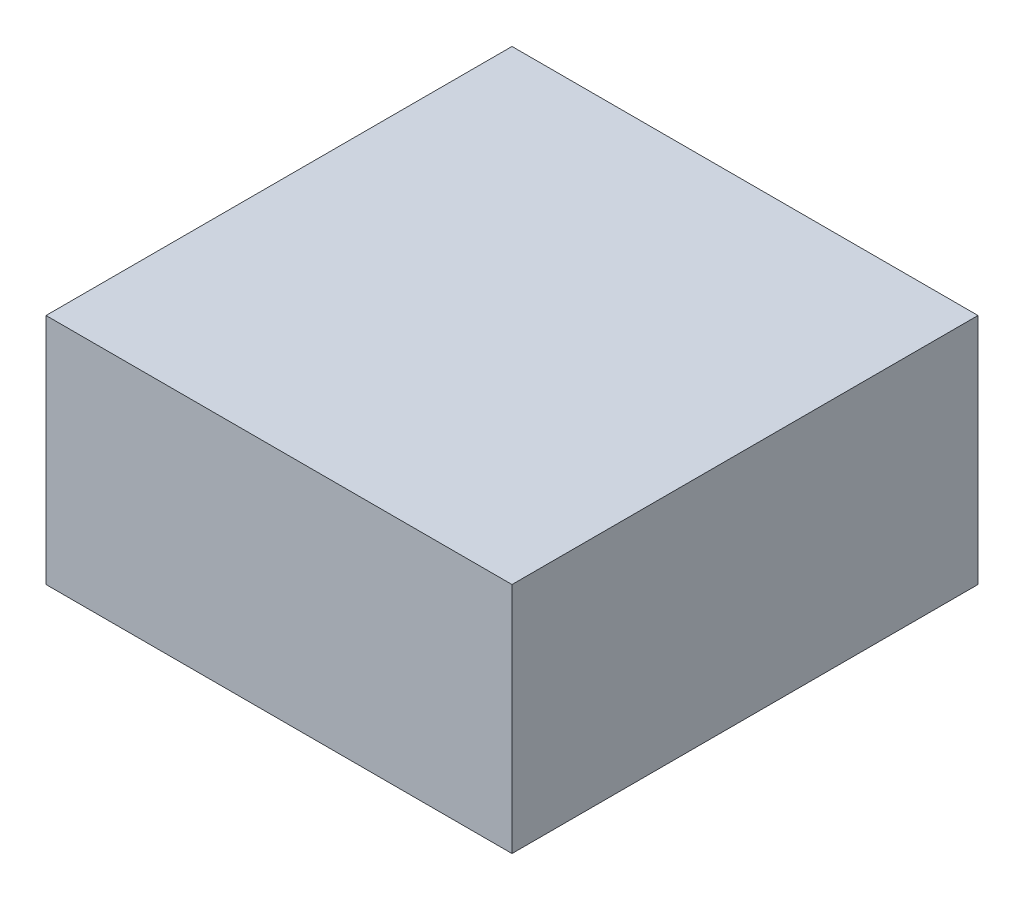
ISO-10303-21;
HEADER;
FILE_DESCRIPTION(('STEP AP214'),'2;1');
FILE_NAME('part.step','',(''),(''),'','','');
FILE_SCHEMA(('AUTOMOTIVE_DESIGN { 1 0 10303 214 1 1 1 1 }'));
ENDSEC;
DATA;
#1=APPLICATION_CONTEXT('core data for automotive mechanical design processes');
#2=APPLICATION_PROTOCOL_DEFINITION('international standard','automotive_design',2000,#1);
#3=PRODUCT_CONTEXT('',#1,'mechanical');
#4=PRODUCT('Part','Part','',(#3));
#5=PRODUCT_RELATED_PRODUCT_CATEGORY('part','',(#4));
#6=PRODUCT_DEFINITION_FORMATION('','',#4);
#7=PRODUCT_DEFINITION_CONTEXT('part definition',#1,'design');
#8=PRODUCT_DEFINITION('design','',#6,#7);
#9=PRODUCT_DEFINITION_SHAPE('','',#8);
#10=(LENGTH_UNIT() NAMED_UNIT(*) SI_UNIT(.MILLI.,.METRE.));
#11=(NAMED_UNIT(*) PLANE_ANGLE_UNIT() SI_UNIT($,.RADIAN.));
#12=(NAMED_UNIT(*) SI_UNIT($,.STERADIAN.) SOLID_ANGLE_UNIT());
#13=UNCERTAINTY_MEASURE_WITH_UNIT(LENGTH_MEASURE(1.E-05),#10,'distance_accuracy_value','');
#14=(GEOMETRIC_REPRESENTATION_CONTEXT(3) GLOBAL_UNCERTAINTY_ASSIGNED_CONTEXT((#13)) GLOBAL_UNIT_ASSIGNED_CONTEXT((#10,
#11,#12)) REPRESENTATION_CONTEXT('',''));
#15=CARTESIAN_POINT('',(0.,0.,0.));
#16=DIRECTION('',(0.,0.,1.));
#17=DIRECTION('',(1.,0.,0.));
#18=AXIS2_PLACEMENT_3D('',#15,#16,#17);
#19=CARTESIAN_POINT('',(0.,200.,0.));
#20=DIRECTION('',(1.,0.,0.));
#21=DIRECTION('',(0.,0.,-1.));
#22=AXIS2_PLACEMENT_3D('',#19,#20,#21);
#23=PLANE('',#22);
#24=DIRECTION('',(0.,0.,1.));
#25=VECTOR('',#24,1.);
#26=CARTESIAN_POINT('',(0.,0.,0.));
#27=LINE('',#26,#25);
#28=CARTESIAN_POINT('',(0.,0.,-400.));
#29=VERTEX_POINT('',#28);
#30=CARTESIAN_POINT('',(0.,0.,0.));
#31=VERTEX_POINT('',#30);
#32=EDGE_CURVE('E107',#29,#31,#27,.T.);
#33=ORIENTED_EDGE('',*,*,#32,.T.);
#34=DIRECTION('',(0.,-1.,0.));
#35=VECTOR('',#34,1.);
#36=CARTESIAN_POINT('',(0.,200.,0.));
#37=LINE('',#36,#35);
#38=CARTESIAN_POINT('',(0.,200.,0.));
#39=VERTEX_POINT('',#38);
#40=EDGE_CURVE('E11',#39,#31,#37,.T.);
#41=ORIENTED_EDGE('',*,*,#40,.F.);
#42=DIRECTION('',(0.,0.,1.));
#43=VECTOR('',#42,1.);
#44=CARTESIAN_POINT('',(0.,200.,0.));
#45=LINE('',#44,#43);
#46=CARTESIAN_POINT('',(0.,200.,-400.));
#47=VERTEX_POINT('',#46);
#48=EDGE_CURVE('E91',#47,#39,#45,.T.);
#49=ORIENTED_EDGE('',*,*,#48,.F.);
#50=DIRECTION('',(0.,-1.,0.));
#51=VECTOR('',#50,1.);
#52=CARTESIAN_POINT('',(0.,200.,-400.));
#53=LINE('',#52,#51);
#54=EDGE_CURVE('E103',#47,#29,#53,.T.);
#55=ORIENTED_EDGE('',*,*,#54,.T.);
#56=EDGE_LOOP('',(#33,#41,#49,#55));
#57=FACE_BOUND('',#56,.T.);
#58=ADVANCED_FACE('F39',(#57),#23,.F.);
#59=CARTESIAN_POINT('',(0.,200.,0.));
#60=DIRECTION('',(0.,0.,-1.));
#61=DIRECTION('',(-1.,0.,0.));
#62=AXIS2_PLACEMENT_3D('',#59,#60,#61);
#63=PLANE('',#62);
#64=DIRECTION('',(1.,0.,0.));
#65=VECTOR('',#64,1.);
#66=CARTESIAN_POINT('',(0.,0.,0.));
#67=LINE('',#66,#65);
#68=CARTESIAN_POINT('',(400.,0.,0.));
#69=VERTEX_POINT('',#68);
#70=EDGE_CURVE('E96',#31,#69,#67,.T.);
#71=ORIENTED_EDGE('',*,*,#70,.T.);
#72=DIRECTION('',(0.,-1.,0.));
#73=VECTOR('',#72,1.);
#74=CARTESIAN_POINT('',(400.,200.,0.));
#75=LINE('',#74,#73);
#76=CARTESIAN_POINT('',(400.,200.,0.));
#77=VERTEX_POINT('',#76);
#78=EDGE_CURVE('E48',#77,#69,#75,.T.);
#79=ORIENTED_EDGE('',*,*,#78,.F.);
#80=DIRECTION('',(1.,0.,0.));
#81=VECTOR('',#80,1.);
#82=CARTESIAN_POINT('',(0.,200.,0.));
#83=LINE('',#82,#81);
#84=EDGE_CURVE('E86',#39,#77,#83,.T.);
#85=ORIENTED_EDGE('',*,*,#84,.F.);
#86=ORIENTED_EDGE('',*,*,#40,.T.);
#87=EDGE_LOOP('',(#71,#79,#85,#86));
#88=FACE_BOUND('',#87,.T.);
#89=ADVANCED_FACE('F95',(#88),#63,.F.);
#90=CARTESIAN_POINT('',(400.,200.,0.));
#91=DIRECTION('',(-1.,0.,0.));
#92=DIRECTION('',(0.,0.,1.));
#93=AXIS2_PLACEMENT_3D('',#90,#91,#92);
#94=PLANE('',#93);
#95=DIRECTION('',(0.,0.,-1.));
#96=VECTOR('',#95,1.);
#97=CARTESIAN_POINT('',(400.,0.,0.));
#98=LINE('',#97,#96);
#99=CARTESIAN_POINT('',(400.,0.,-400.));
#100=VERTEX_POINT('',#99);
#101=EDGE_CURVE('E73',#69,#100,#98,.T.);
#102=ORIENTED_EDGE('',*,*,#101,.T.);
#103=DIRECTION('',(0.,-1.,0.));
#104=VECTOR('',#103,1.);
#105=CARTESIAN_POINT('',(400.,200.,-400.));
#106=LINE('',#105,#104);
#107=CARTESIAN_POINT('',(400.,200.,-400.));
#108=VERTEX_POINT('',#107);
#109=EDGE_CURVE('E98',#108,#100,#106,.T.);
#110=ORIENTED_EDGE('',*,*,#109,.F.);
#111=DIRECTION('',(0.,0.,-1.));
#112=VECTOR('',#111,1.);
#113=CARTESIAN_POINT('',(400.,200.,0.));
#114=LINE('',#113,#112);
#115=EDGE_CURVE('E89',#77,#108,#114,.T.);
#116=ORIENTED_EDGE('',*,*,#115,.F.);
#117=ORIENTED_EDGE('',*,*,#78,.T.);
#118=EDGE_LOOP('',(#102,#110,#116,#117));
#119=FACE_BOUND('',#118,.T.);
#120=ADVANCED_FACE('F99',(#119),#94,.F.);
#121=CARTESIAN_POINT('',(0.,200.,-400.));
#122=DIRECTION('',(0.,0.,1.));
#123=DIRECTION('',(1.,0.,0.));
#124=AXIS2_PLACEMENT_3D('',#121,#122,#123);
#125=PLANE('',#124);
#126=DIRECTION('',(-1.,0.,0.));
#127=VECTOR('',#126,1.);
#128=CARTESIAN_POINT('',(0.,0.,-400.));
#129=LINE('',#128,#127);
#130=EDGE_CURVE('E79',#100,#29,#129,.T.);
#131=ORIENTED_EDGE('',*,*,#130,.T.);
#132=ORIENTED_EDGE('',*,*,#54,.F.);
#133=DIRECTION('',(-1.,0.,0.));
#134=VECTOR('',#133,1.);
#135=CARTESIAN_POINT('',(0.,200.,-400.));
#136=LINE('',#135,#134);
#137=EDGE_CURVE('E56',#108,#47,#136,.T.);
#138=ORIENTED_EDGE('',*,*,#137,.F.);
#139=ORIENTED_EDGE('',*,*,#109,.T.);
#140=EDGE_LOOP('',(#131,#132,#138,#139));
#141=FACE_BOUND('',#140,.T.);
#142=ADVANCED_FACE('F120',(#141),#125,.F.);
#143=CARTESIAN_POINT('',(0.,200.,0.));
#144=DIRECTION('',(0.,-1.,0.));
#145=DIRECTION('',(0.,0.,-1.));
#146=AXIS2_PLACEMENT_3D('',#143,#144,#145);
#147=PLANE('',#146);
#148=ORIENTED_EDGE('',*,*,#48,.T.);
#149=ORIENTED_EDGE('',*,*,#84,.T.);
#150=ORIENTED_EDGE('',*,*,#115,.T.);
#151=ORIENTED_EDGE('',*,*,#137,.T.);
#152=EDGE_LOOP('',(#148,#149,#150,#151));
#153=FACE_BOUND('',#152,.T.);
#154=ADVANCED_FACE('F87',(#153),#147,.F.);
#155=CARTESIAN_POINT('',(0.,0.,0.));
#156=DIRECTION('',(0.,-1.,0.));
#157=DIRECTION('',(0.,0.,-1.));
#158=AXIS2_PLACEMENT_3D('',#155,#156,#157);
#159=PLANE('',#158);
#160=ORIENTED_EDGE('',*,*,#32,.F.);
#161=ORIENTED_EDGE('',*,*,#130,.F.);
#162=ORIENTED_EDGE('',*,*,#101,.F.);
#163=ORIENTED_EDGE('',*,*,#70,.F.);
#164=EDGE_LOOP('',(#160,#161,#162,#163));
#165=FACE_BOUND('',#164,.T.);
#166=ADVANCED_FACE('F123',(#165),#159,.T.);
#167=CLOSED_SHELL('',(#58,#89,#120,#142,#154,#166));
#168=MANIFOLD_SOLID_BREP('B2',#167);
#169=ADVANCED_BREP_SHAPE_REPRESENTATION('',(#18,#168),#14);
#170=SHAPE_DEFINITION_REPRESENTATION(#9,#169);
ENDSEC;
END-ISO-10303-21;
